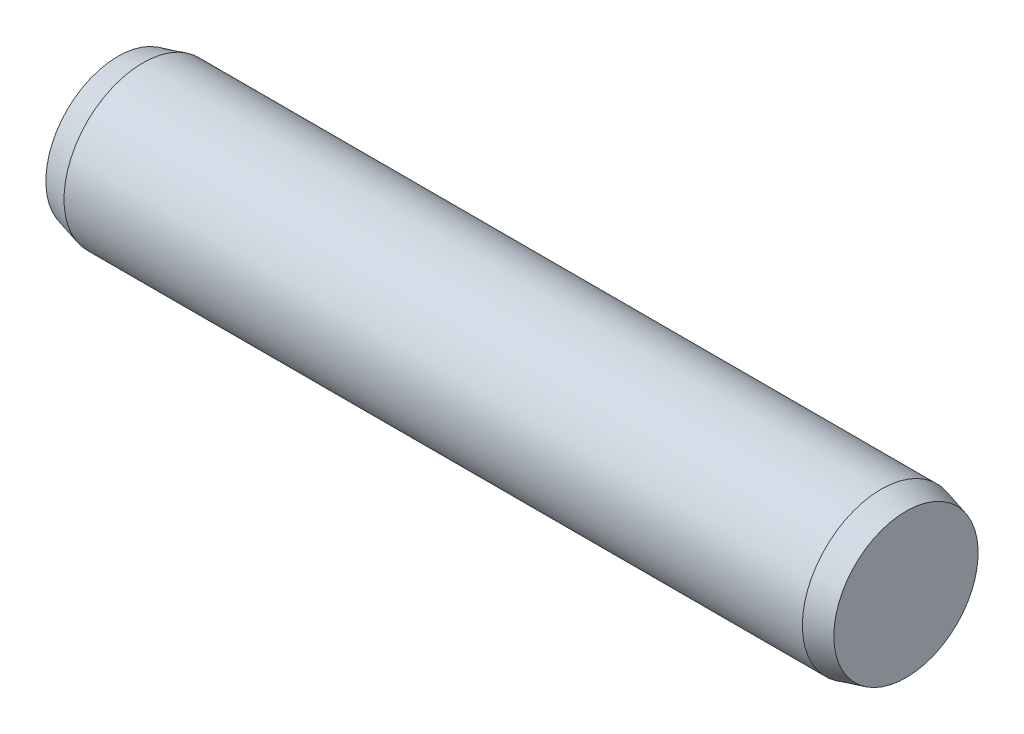
ISO-10303-21;
HEADER;
FILE_DESCRIPTION(('STEP AP214'),'2;1');
FILE_NAME('part.step','',(''),(''),'','','');
FILE_SCHEMA(('AUTOMOTIVE_DESIGN { 1 0 10303 214 1 1 1 1 }'));
ENDSEC;
DATA;
#1=APPLICATION_CONTEXT('core data for automotive mechanical design processes');
#2=APPLICATION_PROTOCOL_DEFINITION('international standard','automotive_design',2000,#1);
#3=PRODUCT_CONTEXT('',#1,'mechanical');
#4=PRODUCT('Part','Part','',(#3));
#5=PRODUCT_RELATED_PRODUCT_CATEGORY('part','',(#4));
#6=PRODUCT_DEFINITION_FORMATION('','',#4);
#7=PRODUCT_DEFINITION_CONTEXT('part definition',#1,'design');
#8=PRODUCT_DEFINITION('design','',#6,#7);
#9=PRODUCT_DEFINITION_SHAPE('','',#8);
#10=(LENGTH_UNIT() NAMED_UNIT(*) SI_UNIT(.MILLI.,.METRE.));
#11=(NAMED_UNIT(*) PLANE_ANGLE_UNIT() SI_UNIT($,.RADIAN.));
#12=(NAMED_UNIT(*) SI_UNIT($,.STERADIAN.) SOLID_ANGLE_UNIT());
#13=UNCERTAINTY_MEASURE_WITH_UNIT(LENGTH_MEASURE(1.E-05),#10,'distance_accuracy_value','');
#14=(GEOMETRIC_REPRESENTATION_CONTEXT(3) GLOBAL_UNCERTAINTY_ASSIGNED_CONTEXT((#13)) GLOBAL_UNIT_ASSIGNED_CONTEXT((#10,
#11,#12)) REPRESENTATION_CONTEXT('',''));
#15=CARTESIAN_POINT('',(0.,0.,0.));
#16=DIRECTION('',(0.,0.,1.));
#17=DIRECTION('',(1.,0.,0.));
#18=AXIS2_PLACEMENT_3D('',#15,#16,#17);
#19=CARTESIAN_POINT('',(-9.99999999999985,0.,0.));
#20=DIRECTION('',(-1.,0.,0.));
#21=DIRECTION('',(0.,0.,1.));
#22=AXIS2_PLACEMENT_3D('',#19,#20,#21);
#23=PLANE('',#22);
#24=CARTESIAN_POINT('',(-10.0000000000477,0.,0.));
#25=DIRECTION('',(1.,0.,0.));
#26=DIRECTION('',(0.,0.,-1.));
#27=AXIS2_PLACEMENT_3D('',#24,#25,#26);
#28=CIRCLE('',#27,1.8311920087533);
#29=CARTESIAN_POINT('',(-10.0000000000477,0.,-1.8311920087533));
#30=VERTEX_POINT('',#29);
#31=EDGE_CURVE('E17',#30,#30,#28,.T.);
#32=ORIENTED_EDGE('',*,*,#31,.F.);
#33=EDGE_LOOP('',(#32));
#34=FACE_BOUND('',#33,.T.);
#35=ADVANCED_FACE('F14',(#34),#23,.T.);
#36=CARTESIAN_POINT('',(10.0000000000001,1.38777878078145E-13,0.));
#37=DIRECTION('',(1.,0.,0.));
#38=DIRECTION('',(0.,0.,-1.));
#39=AXIS2_PLACEMENT_3D('',#36,#37,#38);
#40=PLANE('',#39);
#41=CARTESIAN_POINT('',(10.0000000000477,0.,0.));
#42=DIRECTION('',(-1.,0.,0.));
#43=DIRECTION('',(0.,0.,1.));
#44=AXIS2_PLACEMENT_3D('',#41,#42,#43);
#45=CIRCLE('',#44,1.8311920087533);
#46=CARTESIAN_POINT('',(10.0000000000477,0.,1.8311920087533));
#47=VERTEX_POINT('',#46);
#48=EDGE_CURVE('E26',#47,#47,#45,.T.);
#49=ORIENTED_EDGE('',*,*,#48,.F.);
#50=EDGE_LOOP('',(#49));
#51=FACE_BOUND('',#50,.T.);
#52=ADVANCED_FACE('F37',(#51),#40,.T.);
#53=CARTESIAN_POINT('',(-9.37000000016041,0.,0.));
#54=DIRECTION('',(1.,0.,0.));
#55=DIRECTION('',(0.,0.,-1.));
#56=AXIS2_PLACEMENT_3D('',#53,#54,#55);
#57=CONICAL_SURFACE('',#56,1.99999999998113,0.261799387838262);
#58=CARTESIAN_POINT('',(-9.36999999999994,0.,0.));
#59=DIRECTION('',(1.,0.,0.));
#60=DIRECTION('',(0.,0.,-1.));
#61=AXIS2_PLACEMENT_3D('',#58,#59,#60);
#62=CIRCLE('',#61,2.);
#63=CARTESIAN_POINT('',(-9.36999999999994,0.,-2.));
#64=VERTEX_POINT('',#63);
#65=EDGE_CURVE('E21',#64,#64,#62,.T.);
#66=ORIENTED_EDGE('',*,*,#65,.F.);
#67=EDGE_LOOP('',(#66));
#68=FACE_BOUND('',#67,.T.);
#69=ORIENTED_EDGE('',*,*,#31,.T.);
#70=EDGE_LOOP('',(#69));
#71=FACE_BOUND('',#70,.T.);
#72=ADVANCED_FACE('F34',(#68,#71),#57,.T.);
#73=CARTESIAN_POINT('',(9.37000000016041,0.,0.));
#74=DIRECTION('',(-1.,0.,0.));
#75=DIRECTION('',(0.,0.,1.));
#76=AXIS2_PLACEMENT_3D('',#73,#74,#75);
#77=CONICAL_SURFACE('',#76,1.99999999998113,0.261799387838262);
#78=ORIENTED_EDGE('',*,*,#48,.T.);
#79=EDGE_LOOP('',(#78));
#80=FACE_BOUND('',#79,.T.);
#81=CARTESIAN_POINT('',(9.37000000000006,0.,0.));
#82=DIRECTION('',(1.,0.,0.));
#83=DIRECTION('',(0.,0.,-1.));
#84=AXIS2_PLACEMENT_3D('',#81,#82,#83);
#85=CIRCLE('',#84,2.);
#86=CARTESIAN_POINT('',(9.37000000000007,0.,-1.99999999999999));
#87=VERTEX_POINT('',#86);
#88=EDGE_CURVE('E10',#87,#87,#85,.F.);
#89=ORIENTED_EDGE('',*,*,#88,.F.);
#90=EDGE_LOOP('',(#89));
#91=FACE_BOUND('',#90,.T.);
#92=ADVANCED_FACE('F45',(#80,#91),#77,.T.);
#93=CARTESIAN_POINT('',(-9.36999999999994,0.,0.));
#94=DIRECTION('',(1.,0.,0.));
#95=DIRECTION('',(0.,0.,-1.));
#96=AXIS2_PLACEMENT_3D('',#93,#94,#95);
#97=CYLINDRICAL_SURFACE('',#96,2.);
#98=ORIENTED_EDGE('',*,*,#65,.T.);
#99=EDGE_LOOP('',(#98));
#100=FACE_BOUND('',#99,.T.);
#101=ORIENTED_EDGE('',*,*,#88,.T.);
#102=EDGE_LOOP('',(#101));
#103=FACE_BOUND('',#102,.T.);
#104=ADVANCED_FACE('F43',(#100,#103),#97,.T.);
#105=CLOSED_SHELL('',(#35,#52,#72,#92,#104));
#106=MANIFOLD_SOLID_BREP('B1',#105);
#107=ADVANCED_BREP_SHAPE_REPRESENTATION('',(#18,#106),#14);
#108=SHAPE_DEFINITION_REPRESENTATION(#9,#107);
ENDSEC;
END-ISO-10303-21;
